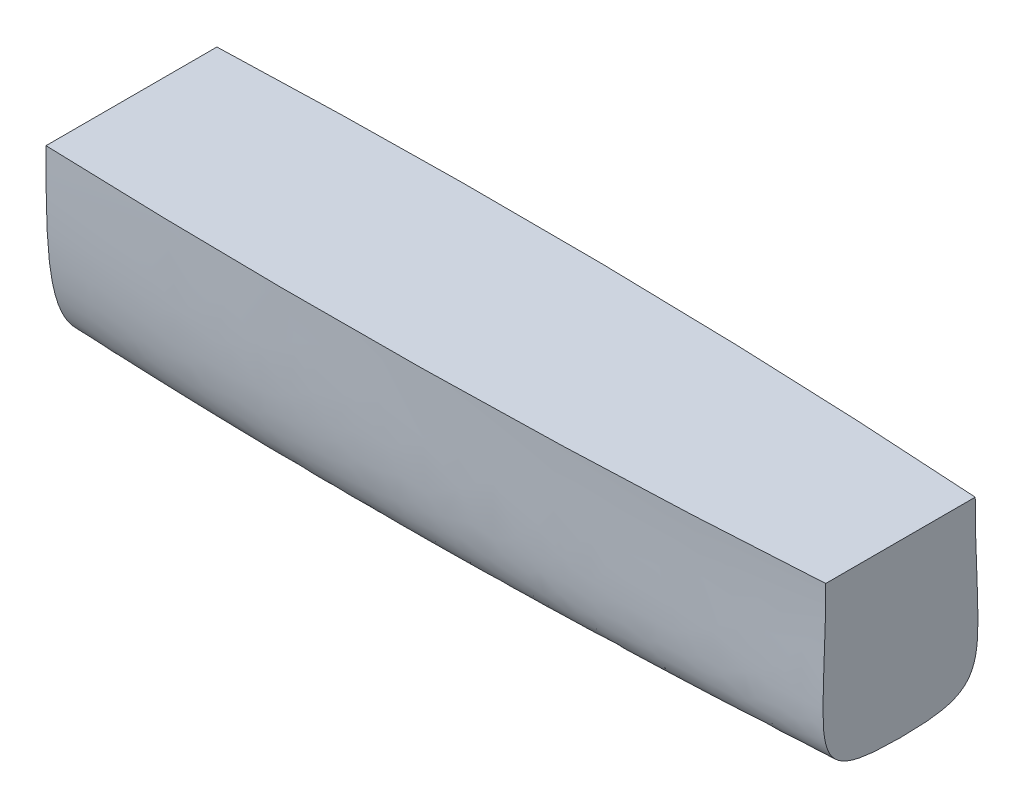
ISO-10303-21;
HEADER;
FILE_DESCRIPTION(('STEP AP214'),'2;1');
FILE_NAME('part.step','',(''),(''),'','','');
FILE_SCHEMA(('AUTOMOTIVE_DESIGN { 1 0 10303 214 1 1 1 1 }'));
ENDSEC;
DATA;
#1=APPLICATION_CONTEXT('core data for automotive mechanical design processes');
#2=APPLICATION_PROTOCOL_DEFINITION('international standard','automotive_design',2000,#1);
#3=PRODUCT_CONTEXT('',#1,'mechanical');
#4=PRODUCT('Part','Part','',(#3));
#5=PRODUCT_RELATED_PRODUCT_CATEGORY('part','',(#4));
#6=PRODUCT_DEFINITION_FORMATION('','',#4);
#7=PRODUCT_DEFINITION_CONTEXT('part definition',#1,'design');
#8=PRODUCT_DEFINITION('design','',#6,#7);
#9=PRODUCT_DEFINITION_SHAPE('','',#8);
#10=(LENGTH_UNIT() NAMED_UNIT(*) SI_UNIT(.MILLI.,.METRE.));
#11=(NAMED_UNIT(*) PLANE_ANGLE_UNIT() SI_UNIT($,.RADIAN.));
#12=(NAMED_UNIT(*) SI_UNIT($,.STERADIAN.) SOLID_ANGLE_UNIT());
#13=UNCERTAINTY_MEASURE_WITH_UNIT(LENGTH_MEASURE(1.E-05),#10,'distance_accuracy_value','');
#14=(GEOMETRIC_REPRESENTATION_CONTEXT(3) GLOBAL_UNCERTAINTY_ASSIGNED_CONTEXT((#13)) GLOBAL_UNIT_ASSIGNED_CONTEXT((#10,
#11,#12)) REPRESENTATION_CONTEXT('',''));
#15=CARTESIAN_POINT('',(0.,0.,0.));
#16=DIRECTION('',(0.,0.,1.));
#17=DIRECTION('',(1.,0.,0.));
#18=AXIS2_PLACEMENT_3D('',#15,#16,#17);
#19=CARTESIAN_POINT('',(0.,0.,0.));
#20=DIRECTION('',(1.,0.,0.));
#21=DIRECTION('',(0.,0.,-1.));
#22=AXIS2_PLACEMENT_3D('',#19,#20,#21);
#23=PLANE('',#22);
#24=DIRECTION('',(0.,0.,-1.));
#25=VECTOR('',#24,1.);
#26=CARTESIAN_POINT('',(0.,101.6,44.45));
#27=LINE('',#26,#25);
#28=CARTESIAN_POINT('',(9.40191802610385E-11,101.6,50.8000000000035));
#29=VERTEX_POINT('',#28);
#30=CARTESIAN_POINT('',(9.40191802610385E-11,101.6,-50.8000000000035));
#31=VERTEX_POINT('',#30);
#32=EDGE_CURVE('E44',#29,#31,#27,.T.);
#33=ORIENTED_EDGE('',*,*,#32,.T.);
#34=CARTESIAN_POINT('',(9.40219175513375E-11,101.6,-50.8000000000035));
#35=CARTESIAN_POINT('',(9.03848008340078E-11,33.8666666666628,-50.800000000004));
#36=CARTESIAN_POINT('',(8.79168231380156E-11,-12.6999999999998,-50.8000000000073));
#37=CARTESIAN_POINT('',(8.88058790979759E-11,-12.6999999999998,0.));
#38=B_SPLINE_CURVE_WITH_KNOTS('',3,(#34,#35,#36,#37),.UNSPECIFIED.,.F.,.F.,(4,4),(0.,1.),.UNSPECIFIED.);
#39=CARTESIAN_POINT('',(0.,-12.6999999999999,0.));
#40=VERTEX_POINT('',#39);
#41=EDGE_CURVE('E11',#31,#40,#38,.T.);
#42=ORIENTED_EDGE('',*,*,#41,.T.);
#43=CARTESIAN_POINT('',(-4.47736069341578E-09,-12.7000000000048,0.));
#44=CARTESIAN_POINT('',(-4.45366732851943E-09,-12.6999707094019,0.781487751641772));
#45=CARTESIAN_POINT('',(-4.42971820009839E-09,-12.6889781682521,1.5630419349123));
#46=CARTESIAN_POINT('',(-4.38192011345438E-09,-12.6437010870272,3.10169913771779));
#47=CARTESIAN_POINT('',(-4.3580902153228E-09,-12.6101342953921,3.85882366023383));
#48=CARTESIAN_POINT('',(-4.31043945637957E-09,-12.5199320026486,5.34902751975938));
#49=CARTESIAN_POINT('',(-4.28663958618666E-09,-12.4640154972523,6.08214958026038));
#50=CARTESIAN_POINT('',(-4.23918911087635E-09,-12.3292978902542,7.52470274285807));
#51=CARTESIAN_POINT('',(-4.21555446043169E-09,-12.2512131273073,8.2342002157884));
#52=CARTESIAN_POINT('',(-4.16826270267955E-09,-12.0723599111245,9.62987044012015));
#53=CARTESIAN_POINT('',(-4.14462530548699E-09,-11.9722988449897,10.3161332422138));
#54=CARTESIAN_POINT('',(-4.09752950081662E-09,-11.7496973949316,11.6656967473971));
#55=CARTESIAN_POINT('',(-4.07408396605494E-09,-11.6278488428377,12.3291109860748));
#56=CARTESIAN_POINT('',(-4.02712035639675E-09,-11.3618845844641,13.6333412633285));
#57=CARTESIAN_POINT('',(-4.00362036377617E-09,-11.218437850424,14.2742931580272));
#58=CARTESIAN_POINT('',(-3.95680463212218E-09,-10.9094968294993,15.5339637655974));
#59=CARTESIAN_POINT('',(-3.93349889224186E-09,-10.744640963376,16.1528385225982));
#60=CARTESIAN_POINT('',(-3.88686751606332E-09,-10.3931093121053,17.3687223145348));
#61=CARTESIAN_POINT('',(-3.8635550752632E-09,-10.2070335469576,17.9659043364015));
#62=CARTESIAN_POINT('',(-3.81699681902432E-09,-9.81329776601531,19.1387736399576));
#63=CARTESIAN_POINT('',(-3.79376047029151E-09,-9.60619170353381,19.7146464528796));
#64=CARTESIAN_POINT('',(-3.74734862029848E-09,-9.170638743577,20.8452730457951));
#65=CARTESIAN_POINT('',(-3.72418093818784E-09,-8.94269263807592,21.400219380165));
#66=CARTESIAN_POINT('',(-3.67784564586512E-09,-8.46571002893252,22.4893745727515));
#67=CARTESIAN_POINT('',(-3.65468520317717E-09,-8.21711505234996,23.0237764990578));
#68=CARTESIAN_POINT('',(-3.60848595195766E-09,-7.69909099889839,24.0722312469046));
#69=CARTESIAN_POINT('',(-3.5854507165306E-09,-7.43003948152166,24.5864703962378));
#70=CARTESIAN_POINT('',(-3.53937030355996E-09,-6.87136292875235,25.5949954602892));
#71=CARTESIAN_POINT('',(-3.51632909795275E-09,-6.58204853747093,26.0894533119272));
#72=CARTESIAN_POINT('',(-3.4703152038318E-09,-5.98310918714257,27.0588194509133));
#73=CARTESIAN_POINT('',(-3.44734429899788E-09,-5.67372701426701,27.5338776660173));
#74=CARTESIAN_POINT('',(-3.40141615486548E-09,-5.0349152857695,28.4648558464261));
#75=CARTESIAN_POINT('',(-3.37846021910957E-09,-4.70566182886777,28.9208966140225));
#76=CARTESIAN_POINT('',(-3.33260349131233E-09,-4.02736876232375,29.8142582167664));
#77=CARTESIAN_POINT('',(-3.30970303997775E-09,-3.6784417905124,30.2516645733004));
#78=CARTESIAN_POINT('',(-3.26392667012989E-09,-2.96105889858107,31.1081815755418));
#79=CARTESIAN_POINT('',(-3.24105084758921E-09,-2.59265721718293,31.5273376606002));
#80=CARTESIAN_POINT('',(-3.19532383563999E-09,-1.83657629941983,32.347782773729));
#81=CARTESIAN_POINT('',(-3.1724726435475E-09,-1.44889943992592,32.7490739932511));
#82=CARTESIAN_POINT('',(-3.12679273175931E-09,-0.654512378917812,33.5342207439993));
#83=CARTESIAN_POINT('',(-3.10396418611828E-09,-0.247760251175753,33.9180338262512));
#84=CARTESIAN_POINT('',(-3.05837700848049E-09,0.584541188637023,34.6686565761279));
#85=CARTESIAN_POINT('',(-3.03561918638764E-09,1.01016864260761,35.0353795219674));
#86=CARTESIAN_POINT('',(-2.99002738659927E-09,1.87999299346549,35.7522534280396));
#87=CARTESIAN_POINT('',(-2.96719393657309E-09,2.32429610799612,36.1022753707059));
#88=CARTESIAN_POINT('',(-2.9216009365089E-09,3.23125234239316,36.786176299614));
#89=CARTESIAN_POINT('',(-2.89884377989147E-09,3.69403197678958,37.1198873018264));
#90=CARTESIAN_POINT('',(-2.85332036073557E-09,4.63772959919391,37.7715917059864));
#91=CARTESIAN_POINT('',(-2.83055652736659E-09,5.11878730134776,38.0893825161859));
#92=CARTESIAN_POINT('',(-2.78504286890497E-09,6.09883641928646,38.7096673099536));
#93=CARTESIAN_POINT('',(-2.76229655939743E-09,6.59797454833304,39.0119291360415));
#94=CARTESIAN_POINT('',(-2.71681655609945E-09,7.61398580238174,39.6015715043192));
#95=CARTESIAN_POINT('',(-2.69408718760793E-09,8.13100744610802,39.8886957138591));
#96=CARTESIAN_POINT('',(-2.64857754172488E-09,9.18259227931243,40.4484731777496));
#97=CARTESIAN_POINT('',(-2.62580143538289E-09,9.71730163586938,40.7208513741957));
#98=CARTESIAN_POINT('',(-2.58030868260116E-09,10.8040711118557,41.251540930432));
#99=CARTESIAN_POINT('',(-2.55759860238851E-09,11.3562718509201,41.5095637587779));
#100=CARTESIAN_POINT('',(-2.51207750930681E-09,12.4778408976706,42.0119446409976));
#101=CARTESIAN_POINT('',(-2.48927105294809E-09,13.047342068145,42.2560056446732));
#102=CARTESIAN_POINT('',(-2.44375872687278E-09,14.203312921084,42.73084834855));
#103=CARTESIAN_POINT('',(-2.42106136439048E-09,14.7899058910274,42.9613287054393));
#104=CARTESIAN_POINT('',(-2.35221451287566E-09,16.5909650041421,43.6395235377354));
#105=CARTESIAN_POINT('',(-2.30655657830168E-09,17.8156729065473,44.0602109546952));
#106=CARTESIAN_POINT('',(-2.21526940078216E-09,20.3301926861742,44.8542729737344));
#107=CARTESIAN_POINT('',(-2.16970426593822E-09,21.620732712122,45.2253086462873));
#108=CARTESIAN_POINT('',(-2.07833635816551E-09,24.2656666833734,45.9231115357718));
#109=CARTESIAN_POINT('',(-2.03258926863268E-09,25.6206349326412,46.2476851700081));
#110=CARTESIAN_POINT('',(-1.94091122802775E-09,28.3930082657146,46.8554982033305));
#111=CARTESIAN_POINT('',(-1.89503776327385E-09,29.8108487118198,47.1367301403007));
#112=CARTESIAN_POINT('',(-1.8031068105125E-09,32.707567119788,47.6607732784165));
#113=CARTESIAN_POINT('',(-1.75710495937111E-09,34.186767289243,47.9017844629283));
#114=CARTESIAN_POINT('',(-1.66493108656309E-09,37.2047678238614,48.3482816640007));
#115=CARTESIAN_POINT('',(-1.61881232092425E-09,38.7438002745625,48.5521804027371));
#116=CARTESIAN_POINT('',(-1.52627915434583E-09,41.8800068374668,48.9273432886412));
#117=CARTESIAN_POINT('',(-1.47991011428412E-09,43.4773438521192,49.0972280818237));
#118=CARTESIAN_POINT('',(-1.38694311716917E-09,46.7286805702724,49.4072770566732));
#119=CARTESIAN_POINT('',(-1.34038920936828E-09,48.3827914468087,49.5462595166903));
#120=CARTESIAN_POINT('',(-1.24701070833235E-09,51.7461740770097,49.7973630062423));
#121=CARTESIAN_POINT('',(-1.20022501944852E-09,53.4555191318386,49.9084835375982));
#122=CARTESIAN_POINT('',(-1.05735405333697E-09,58.7411843474163,50.2106641212133));
#123=CARTESIAN_POINT('',(-9.63162646276416E-10,62.3200696784898,50.3566993833725));
#124=CARTESIAN_POINT('',(-8.22758162324925E-10,67.7654104503835,50.5216473998408));
#125=CARTESIAN_POINT('',(-7.7516905878392E-10,69.6312114045692,50.5679471037314));
#126=CARTESIAN_POINT('',(-6.7969903275123E-10,73.4119103561285,50.6454793729367));
#127=CARTESIAN_POINT('',(-6.3184296751189E-10,75.3268175596709,50.6762867032826));
#128=CARTESIAN_POINT('',(-5.35763610913864E-10,79.2041484885118,50.7258817368804));
#129=CARTESIAN_POINT('',(-4.87560521046109E-10,81.1665758257082,50.7443532487314));
#130=CARTESIAN_POINT('',(-3.90864017270271E-10,85.137414800624,50.7722535915417));
#131=CARTESIAN_POINT('',(-3.42390204111398E-10,87.1458279184803,50.7814607082577));
#132=CARTESIAN_POINT('',(-2.45047892762379E-10,91.2070889082284,50.793870336641));
#133=CARTESIAN_POINT('',(-1.96194377295594E-10,93.2599370936573,50.7969355390775));
#134=CARTESIAN_POINT('',(-9.81199514417062E-11,97.4085249587485,50.7999955091068));
#135=CARTESIAN_POINT('',(-4.89126889609797E-11,99.5042647053791,50.7999247910011));
#136=CARTESIAN_POINT('',(0.,101.6,50.8));
#137=B_SPLINE_CURVE_WITH_KNOTS('',3,(#43,#44,#45,#46,#47,#48,#49,#50,#51,#52,#53,#54,#55,#56,
#57,#58,#59,#60,#61,#62,#63,#64,#65,#66,#67,#68,#69,#70,#71,#72,#73,#74,#75,#76,#77,#78,#79,#80,
#81,#82,#83,#84,#85,#86,#87,#88,#89,#90,#91,#92,#93,#94,#95,#96,#97,#98,#99,#100,#101,#102,#103,
#104,#105,#106,#107,#108,#109,#110,#111,#112,#113,#114,#115,#116,#117,#118,#119,#120,#121,#122,
#123,#124,#125,#126,#127,#128,#129,#130,#131,#132,#133,#134,#135,#136),.UNSPECIFIED.,.F.,.F.,(4,
2,2,2,2,2,2,2,2,2,2,2,2,2,2,2,2,2,2,2,2,2,2,2,2,2,2,2,2,2,2,2,2,2,2,2,2,2,2,2,2,2,2,2,2,2,4),
(0.,2.34448344306046,4.61774226111642,6.82310024341743,8.96402535855335,11.0441331812292,
13.0671882793458,15.0371030237134,16.9579332678533,18.8338703702723,20.6692291084447,
22.4684311716548,24.2359841218744,25.976455971705,27.6944458284447,29.3945513644529,
31.0813341586681,32.7592841724686,34.4327847407006,36.1060794546907,37.7832421862112,
39.4681512670997,41.164468531767,42.87562359078,44.6048033744678,46.3549466998827,
48.1287433942653,49.9286373621692,51.7568329090987,53.61530362153,55.5058031370405,
59.3885196148072,63.4155115389168,67.5941712327691,71.9295940697895,76.4249473575493,
81.0817950020447,85.9003767053856,90.8798446583309,96.0184625913589,106.762495300085,
112.361605648281,118.106994580152,123.994511562909,130.019797185493,136.178345565122,
142.465558891021),.UNSPECIFIED.);
#138=EDGE_CURVE('E38',#40,#29,#137,.T.);
#139=ORIENTED_EDGE('',*,*,#138,.T.);
#140=EDGE_LOOP('',(#33,#42,#139));
#141=FACE_BOUND('',#140,.T.);
#142=ADVANCED_FACE('F35',(#141),#23,.F.);
#143=CARTESIAN_POINT('',(457.2,19.05,44.45));
#144=DIRECTION('',(1.,0.,0.));
#145=DIRECTION('',(0.,0.,-1.));
#146=AXIS2_PLACEMENT_3D('',#143,#144,#145);
#147=PLANE('',#146);
#148=CARTESIAN_POINT('',(457.2,0.,0.));
#149=CARTESIAN_POINT('',(457.2,0.,59.2666666666667));
#150=CARTESIAN_POINT('',(457.2,16.9333333333334,44.45));
#151=CARTESIAN_POINT('',(457.2,101.6,44.45));
#152=B_SPLINE_CURVE_WITH_KNOTS('',3,(#148,#149,#150,#151),.UNSPECIFIED.,.F.,.F.,(4,4),(0.,1.),.UNSPECIFIED.);
#153=CARTESIAN_POINT('',(457.2,0.,0.));
#154=VERTEX_POINT('',#153);
#155=CARTESIAN_POINT('',(457.2,101.6,44.45));
#156=VERTEX_POINT('',#155);
#157=EDGE_CURVE('E98',#154,#156,#152,.T.);
#158=ORIENTED_EDGE('',*,*,#157,.F.);
#159=CARTESIAN_POINT('',(457.2,0.,0.));
#160=CARTESIAN_POINT('',(457.2,0.,-59.2666666666667));
#161=CARTESIAN_POINT('',(457.2,16.9333333333334,-44.45));
#162=CARTESIAN_POINT('',(457.2,101.6,-44.45));
#163=B_SPLINE_CURVE_WITH_KNOTS('',3,(#159,#160,#161,#162),.UNSPECIFIED.,.F.,.F.,(4,4),(0.,1.),.UNSPECIFIED.);
#164=CARTESIAN_POINT('',(457.2,101.6,-44.45));
#165=VERTEX_POINT('',#164);
#166=EDGE_CURVE('E75',#154,#165,#163,.T.);
#167=ORIENTED_EDGE('',*,*,#166,.T.);
#168=DIRECTION('',(0.,0.,1.));
#169=VECTOR('',#168,1.);
#170=CARTESIAN_POINT('',(457.2,101.6,-44.45));
#171=LINE('',#170,#169);
#172=CARTESIAN_POINT('',(457.2,101.6,0.));
#173=VERTEX_POINT('',#172);
#174=EDGE_CURVE('E82',#165,#173,#171,.T.);
#175=ORIENTED_EDGE('',*,*,#174,.T.);
#176=DIRECTION('',(0.,0.,-1.));
#177=VECTOR('',#176,1.);
#178=CARTESIAN_POINT('',(457.2,101.6,44.45));
#179=LINE('',#178,#177);
#180=EDGE_CURVE('E86',#156,#173,#179,.T.);
#181=ORIENTED_EDGE('',*,*,#180,.F.);
#182=EDGE_LOOP('',(#158,#167,#175,#181));
#183=FACE_BOUND('',#182,.T.);
#184=ADVANCED_FACE('F96',(#183),#147,.T.);
#185=CARTESIAN_POINT('',(457.2,101.6,44.45));
#186=DIRECTION('',(0.,1.,0.));
#187=DIRECTION('',(0.,0.,-1.));
#188=AXIS2_PLACEMENT_3D('',#185,#186,#187);
#189=PLANE('',#188);
#190=ORIENTED_EDGE('',*,*,#32,.F.);
#191=CARTESIAN_POINT('',(457.2,101.6,44.45));
#192=CARTESIAN_POINT('',(304.483961546148,101.6,54.6381625895292));
#193=CARTESIAN_POINT('',(-5.77418516651111,101.6,58.6831296847267));
#194=CARTESIAN_POINT('',(-344.221896686963,101.6,29.2381625895292));
#195=CARTESIAN_POINT('',(-515.858787349667,101.6,6.35));
#196=B_SPLINE_CURVE_WITH_KNOTS('',3,(#191,#192,#193,#194,#195),.UNSPECIFIED.,.F.,.F.,(4,1,4),
(0.,0.48021814139568,1.),.UNSPECIFIED.);
#197=EDGE_CURVE('E90',#29,#156,#196,.F.);
#198=ORIENTED_EDGE('',*,*,#197,.T.);
#199=ORIENTED_EDGE('',*,*,#180,.T.);
#200=ORIENTED_EDGE('',*,*,#174,.F.);
#201=CARTESIAN_POINT('',(457.2,101.6,-44.45));
#202=CARTESIAN_POINT('',(304.483961546148,101.6,-54.6381625895292));
#203=CARTESIAN_POINT('',(-5.77418516651111,101.6,-58.6831296847267));
#204=CARTESIAN_POINT('',(-344.221896686963,101.6,-29.2381625895292));
#205=CARTESIAN_POINT('',(-515.858787349667,101.6,-6.35));
#206=B_SPLINE_CURVE_WITH_KNOTS('',3,(#201,#202,#203,#204,#205),.UNSPECIFIED.,.F.,.F.,(4,1,4),
(0.,0.48021814139568,1.),.UNSPECIFIED.);
#207=EDGE_CURVE('E71',#31,#165,#206,.F.);
#208=ORIENTED_EDGE('',*,*,#207,.F.);
#209=EDGE_LOOP('',(#190,#198,#199,#200,#208));
#210=FACE_BOUND('',#209,.T.);
#211=ADVANCED_FACE('F84',(#210),#189,.T.);
#212=CARTESIAN_POINT('',(457.2,0.,0.));
#213=CARTESIAN_POINT('',(304.8,-8.4666666666666,0.));
#214=CARTESIAN_POINT('',(-24.1558528702352,-16.9466068796095,0.));
#215=CARTESIAN_POINT('',(-304.8,-8.4666666666666,0.));
#216=CARTESIAN_POINT('',(-457.2,0.,0.));
#217=CARTESIAN_POINT('',(457.2,0.,59.2666666666667));
#218=CARTESIAN_POINT('',(304.694653848716,-5.6444444444444,62.6627208631764));
#219=CARTESIAN_POINT('',(-27.0609494606047,-19.7776781326826,62.3667373112781));
#220=CARTESIAN_POINT('',(-298.387703112432,-5.6444444444444,11.8627208631764));
#221=CARTESIAN_POINT('',(-457.2,0.,4.23333333333333));
#222=CARTESIAN_POINT('',(457.2,16.9333333333334,44.45));
#223=CARTESIAN_POINT('',(304.589307697432,14.1111111111112,51.2421083930194));
#224=CARTESIAN_POINT('',(-18.5135242684559,41.6700336822248,64.0453866142405));
#225=CARTESIAN_POINT('',(-316.767526907864,40.1189904281121,21.6087750596861));
#226=CARTESIAN_POINT('',(-481.992120683,42.9412126503344,6.35));
#227=CARTESIAN_POINT('',(457.2,101.6,44.45));
#228=CARTESIAN_POINT('',(304.483961546148,101.6,54.6381625895292));
#229=CARTESIAN_POINT('',(-5.77418516651111,101.6,58.6831296847267));
#230=CARTESIAN_POINT('',(-344.221896686963,101.6,29.2381625895292));
#231=CARTESIAN_POINT('',(-515.858787349667,101.6,6.35));
#232=B_SPLINE_SURFACE_WITH_KNOTS('',3,3,((#212,#213,#214,#215,#216),(#217,#218,#219,#220,#221),
(#222,#223,#224,#225,#226),(#227,#228,#229,#230,#231)),.UNSPECIFIED.,.F.,.F.,.F.,(4,4),(4,1,4),
(0.,1.),(0.,0.48021814139568,1.),.UNSPECIFIED.);
#233=CARTESIAN_POINT('',(457.2,0.,0.));
#234=CARTESIAN_POINT('',(304.8,-8.46666666666659,0.));
#235=CARTESIAN_POINT('',(-24.1558528702352,-16.9466068796095,0.));
#236=CARTESIAN_POINT('',(-304.8,-8.46666666666659,0.));
#237=CARTESIAN_POINT('',(-457.2,0.,0.));
#238=B_SPLINE_CURVE_WITH_KNOTS('',3,(#233,#234,#235,#236,#237),.UNSPECIFIED.,.F.,.F.,(4,1,4),
(0.,0.48021814139568,1.),.UNSPECIFIED.);
#239=EDGE_CURVE('E79',#154,#40,#238,.T.);
#240=ORIENTED_EDGE('',*,*,#138,.F.);
#241=ORIENTED_EDGE('',*,*,#239,.F.);
#242=ORIENTED_EDGE('',*,*,#157,.T.);
#243=ORIENTED_EDGE('',*,*,#197,.F.);
#244=EDGE_LOOP('',(#240,#241,#242,#243));
#245=FACE_BOUND('',#244,.T.);
#246=ADVANCED_FACE('F176',(#245),#232,.T.);
#247=CARTESIAN_POINT('',(457.2,0.,0.));
#248=CARTESIAN_POINT('',(304.8,-8.4666666666666,0.));
#249=CARTESIAN_POINT('',(-24.1558528702352,-16.9466068796095,0.));
#250=CARTESIAN_POINT('',(-304.8,-8.4666666666666,0.));
#251=CARTESIAN_POINT('',(-457.2,0.,0.));
#252=CARTESIAN_POINT('',(457.2,0.,-59.2666666666667));
#253=CARTESIAN_POINT('',(304.694653848716,-5.6444444444444,-62.6627208631764));
#254=CARTESIAN_POINT('',(-27.0609494606047,-19.7776781326826,-62.3667373112781));
#255=CARTESIAN_POINT('',(-298.387703112432,-5.6444444444444,-11.8627208631764));
#256=CARTESIAN_POINT('',(-457.2,0.,-4.23333333333333));
#257=CARTESIAN_POINT('',(457.2,16.9333333333334,-44.45));
#258=CARTESIAN_POINT('',(304.589307697432,14.1111111111112,-51.2421083930194));
#259=CARTESIAN_POINT('',(-18.5135242684559,41.6700336822248,-64.0453866142405));
#260=CARTESIAN_POINT('',(-316.767526907864,40.1189904281121,-21.6087750596861));
#261=CARTESIAN_POINT('',(-481.992120683,42.9412126503344,-6.35));
#262=CARTESIAN_POINT('',(457.2,101.6,-44.45));
#263=CARTESIAN_POINT('',(304.483961546148,101.6,-54.6381625895292));
#264=CARTESIAN_POINT('',(-5.77418516651111,101.6,-58.6831296847267));
#265=CARTESIAN_POINT('',(-344.221896686963,101.6,-29.2381625895292));
#266=CARTESIAN_POINT('',(-515.858787349667,101.6,-6.35));
#267=B_SPLINE_SURFACE_WITH_KNOTS('',3,3,((#247,#248,#249,#250,#251),(#252,#253,#254,#255,#256),
(#257,#258,#259,#260,#261),(#262,#263,#264,#265,#266)),.UNSPECIFIED.,.F.,.F.,.F.,(4,4),(4,1,4),
(0.,1.),(0.,0.48021814139568,1.),.UNSPECIFIED.);
#268=ORIENTED_EDGE('',*,*,#41,.F.);
#269=ORIENTED_EDGE('',*,*,#207,.T.);
#270=ORIENTED_EDGE('',*,*,#166,.F.);
#271=ORIENTED_EDGE('',*,*,#239,.T.);
#272=EDGE_LOOP('',(#268,#269,#270,#271));
#273=FACE_BOUND('',#272,.T.);
#274=ADVANCED_FACE('F73',(#273),#267,.F.);
#275=CLOSED_SHELL('',(#142,#184,#211,#246,#274));
#276=MANIFOLD_SOLID_BREP('B2',#275);
#277=ADVANCED_BREP_SHAPE_REPRESENTATION('',(#18,#276),#14);
#278=SHAPE_DEFINITION_REPRESENTATION(#9,#277);
ENDSEC;
END-ISO-10303-21;
